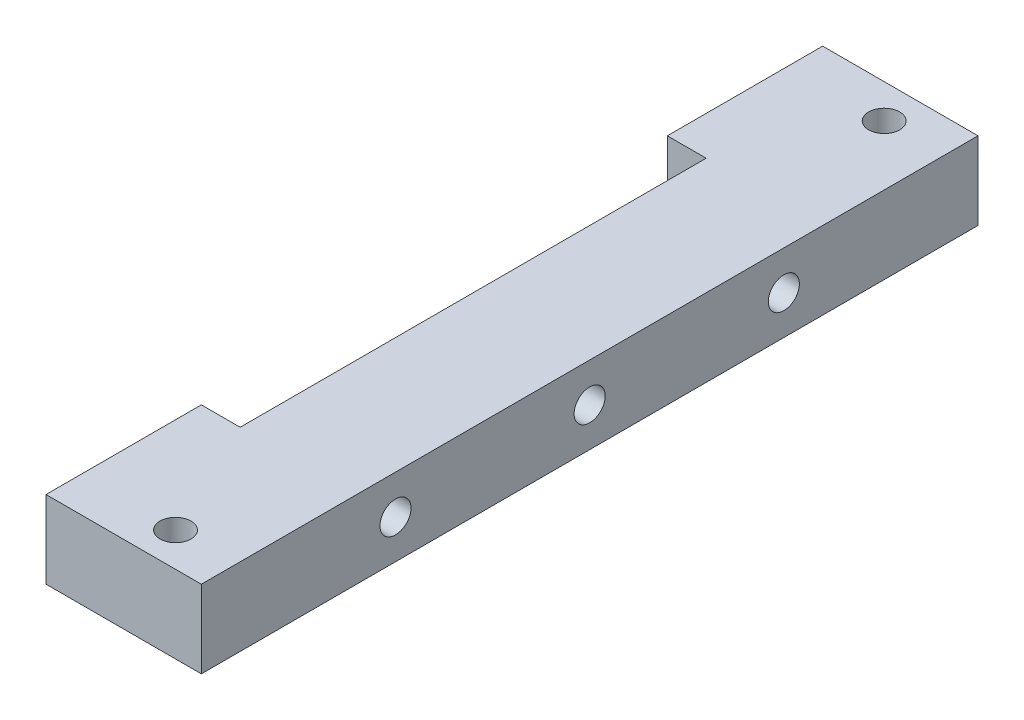
ISO-10303-21;
HEADER;
FILE_DESCRIPTION(('STEP AP214'),'2;1');
FILE_NAME('part.step','',(''),(''),'','','');
FILE_SCHEMA(('AUTOMOTIVE_DESIGN { 1 0 10303 214 1 1 1 1 }'));
ENDSEC;
DATA;
#1=APPLICATION_CONTEXT('core data for automotive mechanical design processes');
#2=APPLICATION_PROTOCOL_DEFINITION('international standard','automotive_design',2000,#1);
#3=PRODUCT_CONTEXT('',#1,'mechanical');
#4=PRODUCT('Part','Part','',(#3));
#5=PRODUCT_RELATED_PRODUCT_CATEGORY('part','',(#4));
#6=PRODUCT_DEFINITION_FORMATION('','',#4);
#7=PRODUCT_DEFINITION_CONTEXT('part definition',#1,'design');
#8=PRODUCT_DEFINITION('design','',#6,#7);
#9=PRODUCT_DEFINITION_SHAPE('','',#8);
#10=(LENGTH_UNIT() NAMED_UNIT(*) SI_UNIT(.MILLI.,.METRE.));
#11=(NAMED_UNIT(*) PLANE_ANGLE_UNIT() SI_UNIT($,.RADIAN.));
#12=(NAMED_UNIT(*) SI_UNIT($,.STERADIAN.) SOLID_ANGLE_UNIT());
#13=UNCERTAINTY_MEASURE_WITH_UNIT(LENGTH_MEASURE(1.E-05),#10,'distance_accuracy_value','');
#14=(GEOMETRIC_REPRESENTATION_CONTEXT(3) GLOBAL_UNCERTAINTY_ASSIGNED_CONTEXT((#13)) GLOBAL_UNIT_ASSIGNED_CONTEXT((#10,
#11,#12)) REPRESENTATION_CONTEXT('',''));
#15=CARTESIAN_POINT('',(0.,0.,0.));
#16=DIRECTION('',(0.,0.,1.));
#17=DIRECTION('',(1.,0.,0.));
#18=AXIS2_PLACEMENT_3D('',#15,#16,#17);
#19=CARTESIAN_POINT('',(16.0507298552724,10.,43.1850034067051));
#20=DIRECTION('',(-1.,0.,0.));
#21=DIRECTION('',(0.,0.,1.));
#22=AXIS2_PLACEMENT_3D('',#19,#20,#21);
#23=PLANE('',#22);
#24=CARTESIAN_POINT('',(16.0507298552724,5.,-6.81499659329485));
#25=DIRECTION('',(-1.,0.,0.));
#26=DIRECTION('',(0.,0.,1.));
#27=AXIS2_PLACEMENT_3D('',#24,#25,#26);
#28=CIRCLE('',#27,2.);
#29=CARTESIAN_POINT('',(16.0507298552724,5.,-4.81499659329485));
#30=VERTEX_POINT('',#29);
#31=EDGE_CURVE('E233',#30,#30,#28,.T.);
#32=ORIENTED_EDGE('',*,*,#31,.T.);
#33=EDGE_LOOP('',(#32));
#34=FACE_BOUND('',#33,.T.);
#35=CARTESIAN_POINT('',(16.0507298552724,5.00000000000001,18.1850034067052));
#36=DIRECTION('',(-1.,0.,0.));
#37=DIRECTION('',(0.,0.,1.));
#38=AXIS2_PLACEMENT_3D('',#35,#36,#37);
#39=CIRCLE('',#38,2.);
#40=CARTESIAN_POINT('',(16.0507298552724,5.00000000000001,20.1850034067052));
#41=VERTEX_POINT('',#40);
#42=EDGE_CURVE('E237',#41,#41,#39,.F.);
#43=ORIENTED_EDGE('',*,*,#42,.F.);
#44=EDGE_LOOP('',(#43));
#45=FACE_BOUND('',#44,.T.);
#46=DIRECTION('',(0.,0.,-1.));
#47=VECTOR('',#46,1.);
#48=CARTESIAN_POINT('',(16.0507298552724,0.,43.1850034067051));
#49=LINE('',#48,#47);
#50=CARTESIAN_POINT('',(16.0507298552724,0.,43.1850034067051));
#51=VERTEX_POINT('',#50);
#52=CARTESIAN_POINT('',(16.0507298552724,0.,-56.8149965932948));
#53=VERTEX_POINT('',#52);
#54=EDGE_CURVE('E138',#51,#53,#49,.T.);
#55=ORIENTED_EDGE('',*,*,#54,.T.);
#56=DIRECTION('',(0.,-1.,0.));
#57=VECTOR('',#56,1.);
#58=CARTESIAN_POINT('',(16.0507298552724,10.,-56.8149965932948));
#59=LINE('',#58,#57);
#60=CARTESIAN_POINT('',(16.0507298552724,10.,-56.8149965932948));
#61=VERTEX_POINT('',#60);
#62=EDGE_CURVE('E51',#61,#53,#59,.T.);
#63=ORIENTED_EDGE('',*,*,#62,.F.);
#64=DIRECTION('',(0.,0.,-1.));
#65=VECTOR('',#64,1.);
#66=CARTESIAN_POINT('',(16.0507298552724,10.,43.1850034067051));
#67=LINE('',#66,#65);
#68=CARTESIAN_POINT('',(16.0507298552724,10.,43.1850034067051));
#69=VERTEX_POINT('',#68);
#70=EDGE_CURVE('E159',#69,#61,#67,.T.);
#71=ORIENTED_EDGE('',*,*,#70,.F.);
#72=DIRECTION('',(0.,-1.,0.));
#73=VECTOR('',#72,1.);
#74=CARTESIAN_POINT('',(16.0507298552724,10.,43.1850034067051));
#75=LINE('',#74,#73);
#76=EDGE_CURVE('E126',#69,#51,#75,.T.);
#77=ORIENTED_EDGE('',*,*,#76,.T.);
#78=EDGE_LOOP('',(#55,#63,#71,#77));
#79=FACE_BOUND('',#78,.T.);
#80=CARTESIAN_POINT('',(16.0507298552724,5.,-31.8149965932949));
#81=DIRECTION('',(-1.,0.,0.));
#82=DIRECTION('',(0.,0.,1.));
#83=AXIS2_PLACEMENT_3D('',#80,#81,#82);
#84=CIRCLE('',#83,2.);
#85=CARTESIAN_POINT('',(16.0507298552724,5.,-29.8149965932949));
#86=VERTEX_POINT('',#85);
#87=EDGE_CURVE('E226',#86,#86,#84,.T.);
#88=ORIENTED_EDGE('',*,*,#87,.T.);
#89=EDGE_LOOP('',(#88));
#90=FACE_BOUND('',#89,.T.);
#91=ADVANCED_FACE('F43',(#34,#45,#79,#90),#23,.F.);
#92=CARTESIAN_POINT('',(1.05072985527239,10.,23.1850034067051));
#93=DIRECTION('',(1.,0.,0.));
#94=DIRECTION('',(0.,0.,-1.));
#95=AXIS2_PLACEMENT_3D('',#92,#93,#94);
#96=PLANE('',#95);
#97=CARTESIAN_POINT('',(1.05072985527239,5.,-6.81499659329485));
#98=DIRECTION('',(-1.,0.,0.));
#99=DIRECTION('',(0.,0.,1.));
#100=AXIS2_PLACEMENT_3D('',#97,#98,#99);
#101=CIRCLE('',#100,2.);
#102=CARTESIAN_POINT('',(1.05072985527239,5.,-4.81499659329485));
#103=VERTEX_POINT('',#102);
#104=EDGE_CURVE('E246',#103,#103,#101,.T.);
#105=ORIENTED_EDGE('',*,*,#104,.F.);
#106=EDGE_LOOP('',(#105));
#107=FACE_BOUND('',#106,.T.);
#108=CARTESIAN_POINT('',(1.05072985527239,5.00000000000001,18.1850034067052));
#109=DIRECTION('',(1.,0.,0.));
#110=DIRECTION('',(0.,0.,-1.));
#111=AXIS2_PLACEMENT_3D('',#108,#109,#110);
#112=CIRCLE('',#111,2.);
#113=CARTESIAN_POINT('',(1.05072985527239,5.00000000000001,16.1850034067052));
#114=VERTEX_POINT('',#113);
#115=EDGE_CURVE('E242',#114,#114,#112,.T.);
#116=ORIENTED_EDGE('',*,*,#115,.T.);
#117=EDGE_LOOP('',(#116));
#118=FACE_BOUND('',#117,.T.);
#119=DIRECTION('',(0.,0.,1.));
#120=VECTOR('',#119,1.);
#121=CARTESIAN_POINT('',(1.05072985527239,0.,23.1850034067051));
#122=LINE('',#121,#120);
#123=CARTESIAN_POINT('',(1.05072985527239,0.,-36.8149965932948));
#124=VERTEX_POINT('',#123);
#125=CARTESIAN_POINT('',(1.05072985527239,0.,23.1850034067051));
#126=VERTEX_POINT('',#125);
#127=EDGE_CURVE('E150',#124,#126,#122,.T.);
#128=ORIENTED_EDGE('',*,*,#127,.T.);
#129=DIRECTION('',(0.,-1.,0.));
#130=VECTOR('',#129,1.);
#131=CARTESIAN_POINT('',(1.05072985527239,10.,23.1850034067051));
#132=LINE('',#131,#130);
#133=CARTESIAN_POINT('',(1.05072985527239,10.,23.1850034067051));
#134=VERTEX_POINT('',#133);
#135=EDGE_CURVE('E132',#134,#126,#132,.T.);
#136=ORIENTED_EDGE('',*,*,#135,.F.);
#137=DIRECTION('',(0.,0.,1.));
#138=VECTOR('',#137,1.);
#139=CARTESIAN_POINT('',(1.05072985527239,10.,23.1850034067051));
#140=LINE('',#139,#138);
#141=CARTESIAN_POINT('',(1.05072985527239,10.,-36.8149965932948));
#142=VERTEX_POINT('',#141);
#143=EDGE_CURVE('E134',#142,#134,#140,.T.);
#144=ORIENTED_EDGE('',*,*,#143,.F.);
#145=DIRECTION('',(0.,-1.,0.));
#146=VECTOR('',#145,1.);
#147=CARTESIAN_POINT('',(1.05072985527239,10.,-36.8149965932948));
#148=LINE('',#147,#146);
#149=EDGE_CURVE('E164',#142,#124,#148,.T.);
#150=ORIENTED_EDGE('',*,*,#149,.T.);
#151=EDGE_LOOP('',(#128,#136,#144,#150));
#152=FACE_BOUND('',#151,.T.);
#153=CARTESIAN_POINT('',(1.05072985527239,5.,-31.8149965932949));
#154=DIRECTION('',(-1.,0.,0.));
#155=DIRECTION('',(0.,0.,1.));
#156=AXIS2_PLACEMENT_3D('',#153,#154,#155);
#157=CIRCLE('',#156,2.);
#158=CARTESIAN_POINT('',(1.05072985527239,5.,-29.8149965932949));
#159=VERTEX_POINT('',#158);
#160=EDGE_CURVE('E241',#159,#159,#157,.T.);
#161=ORIENTED_EDGE('',*,*,#160,.F.);
#162=EDGE_LOOP('',(#161));
#163=FACE_BOUND('',#162,.T.);
#164=ADVANCED_FACE('F197',(#107,#118,#152,#163),#96,.F.);
#165=CARTESIAN_POINT('',(0.,10.,0.));
#166=DIRECTION('',(0.,1.,0.));
#167=DIRECTION('',(0.,0.,1.));
#168=AXIS2_PLACEMENT_3D('',#165,#166,#167);
#169=PLANE('',#168);
#170=DIRECTION('',(0.,0.,-1.));
#171=VECTOR('',#170,1.);
#172=CARTESIAN_POINT('',(-3.94927014472761,10.,0.));
#173=LINE('',#172,#171);
#174=CARTESIAN_POINT('',(-3.94927014472761,10.,43.1850034067051));
#175=VERTEX_POINT('',#174);
#176=CARTESIAN_POINT('',(-3.94927014472761,10.,23.1850034067051));
#177=VERTEX_POINT('',#176);
#178=EDGE_CURVE('E106',#175,#177,#173,.T.);
#179=ORIENTED_EDGE('',*,*,#178,.F.);
#180=DIRECTION('',(1.,0.,0.));
#181=VECTOR('',#180,1.);
#182=CARTESIAN_POINT('',(16.0507298552724,10.,43.1850034067051));
#183=LINE('',#182,#181);
#184=EDGE_CURVE('E116',#175,#69,#183,.T.);
#185=ORIENTED_EDGE('',*,*,#184,.T.);
#186=ORIENTED_EDGE('',*,*,#70,.T.);
#187=DIRECTION('',(-1.,0.,0.));
#188=VECTOR('',#187,1.);
#189=CARTESIAN_POINT('',(16.0507298552724,10.,-56.8149965932948));
#190=LINE('',#189,#188);
#191=CARTESIAN_POINT('',(-3.94927014472761,10.,-56.8149965932948));
#192=VERTEX_POINT('',#191);
#193=EDGE_CURVE('E174',#61,#192,#190,.T.);
#194=ORIENTED_EDGE('',*,*,#193,.T.);
#195=CARTESIAN_POINT('',(-3.94927014472761,10.,-36.8149965932948));
#196=VERTEX_POINT('',#195);
#197=EDGE_CURVE('E123',#196,#192,#173,.T.);
#198=ORIENTED_EDGE('',*,*,#197,.F.);
#199=DIRECTION('',(1.,0.,0.));
#200=VECTOR('',#199,1.);
#201=CARTESIAN_POINT('',(-8.94927014472761,10.,-36.8149965932948));
#202=LINE('',#201,#200);
#203=EDGE_CURVE('E203',#196,#142,#202,.T.);
#204=ORIENTED_EDGE('',*,*,#203,.T.);
#205=ORIENTED_EDGE('',*,*,#143,.T.);
#206=DIRECTION('',(-1.,0.,0.));
#207=VECTOR('',#206,1.);
#208=CARTESIAN_POINT('',(-8.94927014472761,10.,23.1850034067051));
#209=LINE('',#208,#207);
#210=EDGE_CURVE('E119',#134,#177,#209,.T.);
#211=ORIENTED_EDGE('',*,*,#210,.T.);
#212=EDGE_LOOP('',(#179,#185,#186,#194,#198,#204,#205,#211));
#213=FACE_BOUND('',#212,.T.);
#214=CARTESIAN_POINT('',(8.34888595440326,10.,-52.4361029338164));
#215=DIRECTION('',(0.,1.,0.));
#216=DIRECTION('',(0.,0.,1.));
#217=AXIS2_PLACEMENT_3D('',#214,#215,#216);
#218=CIRCLE('',#217,2.);
#219=CARTESIAN_POINT('',(8.34888595440326,10.,-50.4361029338164));
#220=VERTEX_POINT('',#219);
#221=EDGE_CURVE('E143',#220,#220,#218,.T.);
#222=ORIENTED_EDGE('',*,*,#221,.F.);
#223=EDGE_LOOP('',(#222));
#224=FACE_BOUND('',#223,.T.);
#225=CARTESIAN_POINT('',(8.34888595440326,10.,38.8061097472267));
#226=DIRECTION('',(0.,1.,0.));
#227=DIRECTION('',(0.,0.,1.));
#228=AXIS2_PLACEMENT_3D('',#225,#226,#227);
#229=CIRCLE('',#228,2.00000000000001);
#230=CARTESIAN_POINT('',(8.34888595440326,10.,40.8061097472267));
#231=VERTEX_POINT('',#230);
#232=EDGE_CURVE('E218',#231,#231,#229,.T.);
#233=ORIENTED_EDGE('',*,*,#232,.F.);
#234=EDGE_LOOP('',(#233));
#235=FACE_BOUND('',#234,.T.);
#236=ADVANCED_FACE('F113',(#213,#224,#235),#169,.T.);
#237=CARTESIAN_POINT('',(0.,0.,0.));
#238=DIRECTION('',(0.,1.,0.));
#239=DIRECTION('',(0.,0.,1.));
#240=AXIS2_PLACEMENT_3D('',#237,#238,#239);
#241=PLANE('',#240);
#242=DIRECTION('',(1.,0.,0.));
#243=VECTOR('',#242,1.);
#244=CARTESIAN_POINT('',(16.0507298552724,0.,43.1850034067051));
#245=LINE('',#244,#243);
#246=CARTESIAN_POINT('',(-3.94927014472761,0.,43.1850034067051));
#247=VERTEX_POINT('',#246);
#248=EDGE_CURVE('E157',#247,#51,#245,.T.);
#249=ORIENTED_EDGE('',*,*,#248,.F.);
#250=DIRECTION('',(0.,0.,-1.));
#251=VECTOR('',#250,1.);
#252=CARTESIAN_POINT('',(-3.94927014472761,0.,0.));
#253=LINE('',#252,#251);
#254=CARTESIAN_POINT('',(-3.94927014472761,0.,23.1850034067051));
#255=VERTEX_POINT('',#254);
#256=EDGE_CURVE('E66',#247,#255,#253,.T.);
#257=ORIENTED_EDGE('',*,*,#256,.T.);
#258=DIRECTION('',(-1.,0.,0.));
#259=VECTOR('',#258,1.);
#260=CARTESIAN_POINT('',(-8.94927014472761,0.,23.1850034067051));
#261=LINE('',#260,#259);
#262=EDGE_CURVE('E153',#126,#255,#261,.T.);
#263=ORIENTED_EDGE('',*,*,#262,.F.);
#264=ORIENTED_EDGE('',*,*,#127,.F.);
#265=DIRECTION('',(1.,0.,0.));
#266=VECTOR('',#265,1.);
#267=CARTESIAN_POINT('',(-8.94927014472761,0.,-36.8149965932948));
#268=LINE('',#267,#266);
#269=CARTESIAN_POINT('',(-3.94927014472761,0.,-36.8149965932948));
#270=VERTEX_POINT('',#269);
#271=EDGE_CURVE('E147',#270,#124,#268,.T.);
#272=ORIENTED_EDGE('',*,*,#271,.F.);
#273=CARTESIAN_POINT('',(-3.94927014472761,0.,-56.8149965932948));
#274=VERTEX_POINT('',#273);
#275=EDGE_CURVE('E58',#270,#274,#253,.T.);
#276=ORIENTED_EDGE('',*,*,#275,.T.);
#277=DIRECTION('',(-1.,0.,0.));
#278=VECTOR('',#277,1.);
#279=CARTESIAN_POINT('',(16.0507298552724,0.,-56.8149965932948));
#280=LINE('',#279,#278);
#281=EDGE_CURVE('E142',#53,#274,#280,.T.);
#282=ORIENTED_EDGE('',*,*,#281,.F.);
#283=ORIENTED_EDGE('',*,*,#54,.F.);
#284=EDGE_LOOP('',(#249,#257,#263,#264,#272,#276,#282,#283));
#285=FACE_BOUND('',#284,.T.);
#286=CARTESIAN_POINT('',(8.34888595440326,0.,-52.4361029338164));
#287=DIRECTION('',(0.,1.,0.));
#288=DIRECTION('',(0.,0.,1.));
#289=AXIS2_PLACEMENT_3D('',#286,#287,#288);
#290=CIRCLE('',#289,2.);
#291=CARTESIAN_POINT('',(8.34888595440326,0.,-50.4361029338164));
#292=VERTEX_POINT('',#291);
#293=EDGE_CURVE('E214',#292,#292,#290,.T.);
#294=ORIENTED_EDGE('',*,*,#293,.T.);
#295=EDGE_LOOP('',(#294));
#296=FACE_BOUND('',#295,.T.);
#297=CARTESIAN_POINT('',(8.34888595440326,0.,38.8061097472267));
#298=DIRECTION('',(0.,1.,0.));
#299=DIRECTION('',(0.,0.,1.));
#300=AXIS2_PLACEMENT_3D('',#297,#298,#299);
#301=CIRCLE('',#300,2.00000000000001);
#302=CARTESIAN_POINT('',(8.34888595440326,0.,40.8061097472267));
#303=VERTEX_POINT('',#302);
#304=EDGE_CURVE('E222',#303,#303,#301,.T.);
#305=ORIENTED_EDGE('',*,*,#304,.T.);
#306=EDGE_LOOP('',(#305));
#307=FACE_BOUND('',#306,.T.);
#308=ADVANCED_FACE('F179',(#285,#296,#307),#241,.F.);
#309=CARTESIAN_POINT('',(16.0507298552724,10.,-56.8149965932948));
#310=DIRECTION('',(0.,0.,1.));
#311=DIRECTION('',(1.,0.,0.));
#312=AXIS2_PLACEMENT_3D('',#309,#310,#311);
#313=PLANE('',#312);
#314=ORIENTED_EDGE('',*,*,#281,.T.);
#315=DIRECTION('',(0.,1.,0.));
#316=VECTOR('',#315,1.);
#317=CARTESIAN_POINT('',(-3.94927014472761,10.,-56.8149965932948));
#318=LINE('',#317,#316);
#319=EDGE_CURVE('E188',#274,#192,#318,.T.);
#320=ORIENTED_EDGE('',*,*,#319,.T.);
#321=ORIENTED_EDGE('',*,*,#193,.F.);
#322=ORIENTED_EDGE('',*,*,#62,.T.);
#323=EDGE_LOOP('',(#314,#320,#321,#322));
#324=FACE_BOUND('',#323,.T.);
#325=ADVANCED_FACE('F171',(#324),#313,.F.);
#326=CARTESIAN_POINT('',(-8.94927014472761,10.,-36.8149965932948));
#327=DIRECTION('',(0.,0.,-1.));
#328=DIRECTION('',(-1.,0.,0.));
#329=AXIS2_PLACEMENT_3D('',#326,#327,#328);
#330=PLANE('',#329);
#331=ORIENTED_EDGE('',*,*,#203,.F.);
#332=DIRECTION('',(0.,-1.,0.));
#333=VECTOR('',#332,1.);
#334=CARTESIAN_POINT('',(-3.94927014472761,10.,-36.8149965932948));
#335=LINE('',#334,#333);
#336=EDGE_CURVE('E184',#196,#270,#335,.T.);
#337=ORIENTED_EDGE('',*,*,#336,.T.);
#338=ORIENTED_EDGE('',*,*,#271,.T.);
#339=ORIENTED_EDGE('',*,*,#149,.F.);
#340=EDGE_LOOP('',(#331,#337,#338,#339));
#341=FACE_BOUND('',#340,.T.);
#342=ADVANCED_FACE('F202',(#341),#330,.F.);
#343=CARTESIAN_POINT('',(-8.94927014472761,10.,23.1850034067051));
#344=DIRECTION('',(0.,0.,1.));
#345=DIRECTION('',(1.,0.,0.));
#346=AXIS2_PLACEMENT_3D('',#343,#344,#345);
#347=PLANE('',#346);
#348=ORIENTED_EDGE('',*,*,#262,.T.);
#349=DIRECTION('',(0.,1.,0.));
#350=VECTOR('',#349,1.);
#351=CARTESIAN_POINT('',(-3.94927014472761,10.,23.1850034067051));
#352=LINE('',#351,#350);
#353=EDGE_CURVE('E121',#255,#177,#352,.T.);
#354=ORIENTED_EDGE('',*,*,#353,.T.);
#355=ORIENTED_EDGE('',*,*,#210,.F.);
#356=ORIENTED_EDGE('',*,*,#135,.T.);
#357=EDGE_LOOP('',(#348,#354,#355,#356));
#358=FACE_BOUND('',#357,.T.);
#359=ADVANCED_FACE('F193',(#358),#347,.F.);
#360=CARTESIAN_POINT('',(16.0507298552724,10.,43.1850034067051));
#361=DIRECTION('',(0.,0.,-1.));
#362=DIRECTION('',(-1.,0.,0.));
#363=AXIS2_PLACEMENT_3D('',#360,#361,#362);
#364=PLANE('',#363);
#365=ORIENTED_EDGE('',*,*,#184,.F.);
#366=DIRECTION('',(0.,-1.,0.));
#367=VECTOR('',#366,1.);
#368=CARTESIAN_POINT('',(-3.94927014472761,10.,43.1850034067051));
#369=LINE('',#368,#367);
#370=EDGE_CURVE('E13',#175,#247,#369,.T.);
#371=ORIENTED_EDGE('',*,*,#370,.T.);
#372=ORIENTED_EDGE('',*,*,#248,.T.);
#373=ORIENTED_EDGE('',*,*,#76,.F.);
#374=EDGE_LOOP('',(#365,#371,#372,#373));
#375=FACE_BOUND('',#374,.T.);
#376=ADVANCED_FACE('F124',(#375),#364,.F.);
#377=CARTESIAN_POINT('',(8.34888595440326,10.,-52.4361029338164));
#378=DIRECTION('',(0.,-1.,0.));
#379=DIRECTION('',(0.,0.,-1.));
#380=AXIS2_PLACEMENT_3D('',#377,#378,#379);
#381=CYLINDRICAL_SURFACE('',#380,2.);
#382=ORIENTED_EDGE('',*,*,#221,.T.);
#383=EDGE_LOOP('',(#382));
#384=FACE_BOUND('',#383,.T.);
#385=ORIENTED_EDGE('',*,*,#293,.F.);
#386=EDGE_LOOP('',(#385));
#387=FACE_BOUND('',#386,.T.);
#388=ADVANCED_FACE('F285',(#384,#387),#381,.F.);
#389=CARTESIAN_POINT('',(8.34888595440326,10.,38.8061097472267));
#390=DIRECTION('',(0.,-1.,0.));
#391=DIRECTION('',(0.,0.,-1.));
#392=AXIS2_PLACEMENT_3D('',#389,#390,#391);
#393=CYLINDRICAL_SURFACE('',#392,2.00000000000001);
#394=ORIENTED_EDGE('',*,*,#232,.T.);
#395=EDGE_LOOP('',(#394));
#396=FACE_BOUND('',#395,.T.);
#397=ORIENTED_EDGE('',*,*,#304,.F.);
#398=EDGE_LOOP('',(#397));
#399=FACE_BOUND('',#398,.T.);
#400=ADVANCED_FACE('F291',(#396,#399),#393,.F.);
#401=CARTESIAN_POINT('',(31.0507298552724,5.00000000000001,18.1850034067052));
#402=DIRECTION('',(-1.,0.,0.));
#403=DIRECTION('',(0.,0.,1.));
#404=AXIS2_PLACEMENT_3D('',#401,#402,#403);
#405=CYLINDRICAL_SURFACE('',#404,2.);
#406=ORIENTED_EDGE('',*,*,#115,.F.);
#407=EDGE_LOOP('',(#406));
#408=FACE_BOUND('',#407,.T.);
#409=ORIENTED_EDGE('',*,*,#42,.T.);
#410=EDGE_LOOP('',(#409));
#411=FACE_BOUND('',#410,.T.);
#412=ADVANCED_FACE('F332',(#408,#411),#405,.F.);
#413=CARTESIAN_POINT('',(31.0507298552724,5.,-6.81499659329485));
#414=DIRECTION('',(-1.,0.,0.));
#415=DIRECTION('',(0.,0.,1.));
#416=AXIS2_PLACEMENT_3D('',#413,#414,#415);
#417=CYLINDRICAL_SURFACE('',#416,2.);
#418=ORIENTED_EDGE('',*,*,#104,.T.);
#419=EDGE_LOOP('',(#418));
#420=FACE_BOUND('',#419,.T.);
#421=ORIENTED_EDGE('',*,*,#31,.F.);
#422=EDGE_LOOP('',(#421));
#423=FACE_BOUND('',#422,.T.);
#424=ADVANCED_FACE('F321',(#420,#423),#417,.F.);
#425=CARTESIAN_POINT('',(31.0507298552724,5.,-31.8149965932949));
#426=DIRECTION('',(-1.,0.,0.));
#427=DIRECTION('',(0.,0.,1.));
#428=AXIS2_PLACEMENT_3D('',#425,#426,#427);
#429=CYLINDRICAL_SURFACE('',#428,2.);
#430=ORIENTED_EDGE('',*,*,#160,.T.);
#431=EDGE_LOOP('',(#430));
#432=FACE_BOUND('',#431,.T.);
#433=ORIENTED_EDGE('',*,*,#87,.F.);
#434=EDGE_LOOP('',(#433));
#435=FACE_BOUND('',#434,.T.);
#436=ADVANCED_FACE('F258',(#432,#435),#429,.F.);
#437=CARTESIAN_POINT('',(-3.94927014472761,10.,23.1850034067051));
#438=DIRECTION('',(1.,0.,0.));
#439=DIRECTION('',(0.,0.,-1.));
#440=AXIS2_PLACEMENT_3D('',#437,#438,#439);
#441=PLANE('',#440);
#442=ORIENTED_EDGE('',*,*,#256,.F.);
#443=ORIENTED_EDGE('',*,*,#370,.F.);
#444=ORIENTED_EDGE('',*,*,#178,.T.);
#445=ORIENTED_EDGE('',*,*,#353,.F.);
#446=EDGE_LOOP('',(#442,#443,#444,#445));
#447=FACE_BOUND('',#446,.T.);
#448=ADVANCED_FACE('F105',(#447),#441,.F.);
#449=ORIENTED_EDGE('',*,*,#275,.F.);
#450=ORIENTED_EDGE('',*,*,#336,.F.);
#451=ORIENTED_EDGE('',*,*,#197,.T.);
#452=ORIENTED_EDGE('',*,*,#319,.F.);
#453=EDGE_LOOP('',(#449,#450,#451,#452));
#454=FACE_BOUND('',#453,.T.);
#455=ADVANCED_FACE('F205',(#454),#441,.F.);
#456=CLOSED_SHELL('',(#91,#164,#236,#308,#325,#342,#359,#376,#388,#400,#412,#424,#436,#448,#455));
#457=MANIFOLD_SOLID_BREP('B2',#456);
#458=ADVANCED_BREP_SHAPE_REPRESENTATION('',(#18,#457),#14);
#459=SHAPE_DEFINITION_REPRESENTATION(#9,#458);
ENDSEC;
END-ISO-10303-21;
